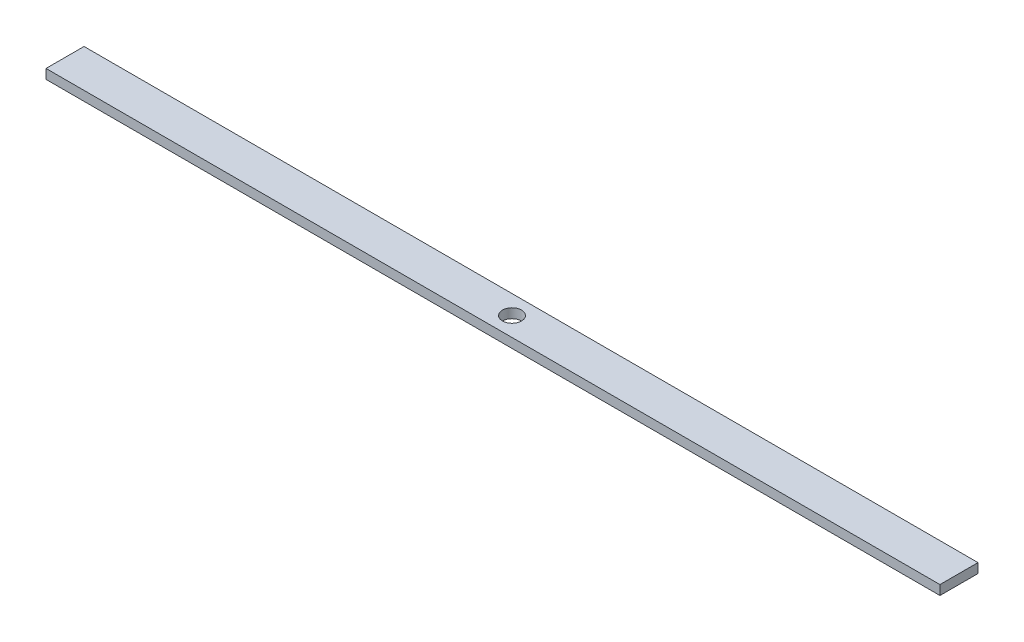
ISO-10303-21;
HEADER;
FILE_DESCRIPTION(('STEP AP214'),'2;1');
FILE_NAME('part.step','',(''),(''),'','','');
FILE_SCHEMA(('AUTOMOTIVE_DESIGN { 1 0 10303 214 1 1 1 1 }'));
ENDSEC;
DATA;
#1=APPLICATION_CONTEXT('core data for automotive mechanical design processes');
#2=APPLICATION_PROTOCOL_DEFINITION('international standard','automotive_design',2000,#1);
#3=PRODUCT_CONTEXT('',#1,'mechanical');
#4=PRODUCT('Part','Part','',(#3));
#5=PRODUCT_RELATED_PRODUCT_CATEGORY('part','',(#4));
#6=PRODUCT_DEFINITION_FORMATION('','',#4);
#7=PRODUCT_DEFINITION_CONTEXT('part definition',#1,'design');
#8=PRODUCT_DEFINITION('design','',#6,#7);
#9=PRODUCT_DEFINITION_SHAPE('','',#8);
#10=(LENGTH_UNIT() NAMED_UNIT(*) SI_UNIT(.MILLI.,.METRE.));
#11=(NAMED_UNIT(*) PLANE_ANGLE_UNIT() SI_UNIT($,.RADIAN.));
#12=(NAMED_UNIT(*) SI_UNIT($,.STERADIAN.) SOLID_ANGLE_UNIT());
#13=UNCERTAINTY_MEASURE_WITH_UNIT(LENGTH_MEASURE(1.E-05),#10,'distance_accuracy_value','');
#14=(GEOMETRIC_REPRESENTATION_CONTEXT(3) GLOBAL_UNCERTAINTY_ASSIGNED_CONTEXT((#13)) GLOBAL_UNIT_ASSIGNED_CONTEXT((#10,
#11,#12)) REPRESENTATION_CONTEXT('',''));
#15=CARTESIAN_POINT('',(0.,0.,0.));
#16=DIRECTION('',(0.,0.,1.));
#17=DIRECTION('',(1.,0.,0.));
#18=AXIS2_PLACEMENT_3D('',#15,#16,#17);
#19=CARTESIAN_POINT('',(0.,6.35,0.));
#20=DIRECTION('',(0.,1.,0.));
#21=DIRECTION('',(0.,0.,1.));
#22=AXIS2_PLACEMENT_3D('',#19,#20,#21);
#23=PLANE('',#22);
#24=DIRECTION('',(0.,0.,-1.));
#25=VECTOR('',#24,1.);
#26=CARTESIAN_POINT('',(298.45,6.35,-12.7));
#27=LINE('',#26,#25);
#28=CARTESIAN_POINT('',(298.45,6.35,12.7));
#29=VERTEX_POINT('',#28);
#30=CARTESIAN_POINT('',(298.45,6.35,-12.7));
#31=VERTEX_POINT('',#30);
#32=EDGE_CURVE('E92',#29,#31,#27,.T.);
#33=ORIENTED_EDGE('',*,*,#32,.T.);
#34=DIRECTION('',(-1.,0.,0.));
#35=VECTOR('',#34,1.);
#36=CARTESIAN_POINT('',(-298.45,6.35,-12.7));
#37=LINE('',#36,#35);
#38=CARTESIAN_POINT('',(-298.45,6.35,-12.7));
#39=VERTEX_POINT('',#38);
#40=EDGE_CURVE('E87',#31,#39,#37,.T.);
#41=ORIENTED_EDGE('',*,*,#40,.T.);
#42=DIRECTION('',(0.,0.,1.));
#43=VECTOR('',#42,1.);
#44=CARTESIAN_POINT('',(-298.45,6.35,-12.7));
#45=LINE('',#44,#43);
#46=CARTESIAN_POINT('',(-298.45,6.35,12.7));
#47=VERTEX_POINT('',#46);
#48=EDGE_CURVE('E90',#39,#47,#45,.T.);
#49=ORIENTED_EDGE('',*,*,#48,.T.);
#50=DIRECTION('',(1.,0.,0.));
#51=VECTOR('',#50,1.);
#52=CARTESIAN_POINT('',(-298.45,6.35,12.7));
#53=LINE('',#52,#51);
#54=EDGE_CURVE('E57',#47,#29,#53,.T.);
#55=ORIENTED_EDGE('',*,*,#54,.T.);
#56=EDGE_LOOP('',(#33,#41,#49,#55));
#57=FACE_BOUND('',#56,.T.);
#58=CARTESIAN_POINT('',(0.,6.35,0.));
#59=DIRECTION('',(0.,1.,0.));
#60=DIRECTION('',(0.,0.,1.));
#61=AXIS2_PLACEMENT_3D('',#58,#59,#60);
#62=CIRCLE('',#61,6.35);
#63=CARTESIAN_POINT('',(0.,6.35,6.35000000000001));
#64=VERTEX_POINT('',#63);
#65=EDGE_CURVE('E112',#64,#64,#62,.T.);
#66=ORIENTED_EDGE('',*,*,#65,.F.);
#67=EDGE_LOOP('',(#66));
#68=FACE_BOUND('',#67,.T.);
#69=ADVANCED_FACE('F39',(#57,#68),#23,.T.);
#70=CARTESIAN_POINT('',(0.,0.,0.));
#71=DIRECTION('',(0.,1.,0.));
#72=DIRECTION('',(0.,0.,1.));
#73=AXIS2_PLACEMENT_3D('',#70,#71,#72);
#74=PLANE('',#73);
#75=DIRECTION('',(0.,0.,-1.));
#76=VECTOR('',#75,1.);
#77=CARTESIAN_POINT('',(298.45,0.,-12.7));
#78=LINE('',#77,#76);
#79=CARTESIAN_POINT('',(298.45,0.,12.7));
#80=VERTEX_POINT('',#79);
#81=CARTESIAN_POINT('',(298.45,0.,-12.7));
#82=VERTEX_POINT('',#81);
#83=EDGE_CURVE('E108',#80,#82,#78,.T.);
#84=ORIENTED_EDGE('',*,*,#83,.F.);
#85=DIRECTION('',(1.,0.,0.));
#86=VECTOR('',#85,1.);
#87=CARTESIAN_POINT('',(-298.45,0.,12.7));
#88=LINE('',#87,#86);
#89=CARTESIAN_POINT('',(-298.45,0.,12.7));
#90=VERTEX_POINT('',#89);
#91=EDGE_CURVE('E80',#90,#80,#88,.T.);
#92=ORIENTED_EDGE('',*,*,#91,.F.);
#93=DIRECTION('',(0.,0.,1.));
#94=VECTOR('',#93,1.);
#95=CARTESIAN_POINT('',(-298.45,0.,-12.7));
#96=LINE('',#95,#94);
#97=CARTESIAN_POINT('',(-298.45,0.,-12.7));
#98=VERTEX_POINT('',#97);
#99=EDGE_CURVE('E74',#98,#90,#96,.T.);
#100=ORIENTED_EDGE('',*,*,#99,.F.);
#101=DIRECTION('',(-1.,0.,0.));
#102=VECTOR('',#101,1.);
#103=CARTESIAN_POINT('',(-298.45,0.,-12.7));
#104=LINE('',#103,#102);
#105=EDGE_CURVE('E97',#82,#98,#104,.T.);
#106=ORIENTED_EDGE('',*,*,#105,.F.);
#107=EDGE_LOOP('',(#84,#92,#100,#106));
#108=FACE_BOUND('',#107,.T.);
#109=CARTESIAN_POINT('',(0.,0.,0.));
#110=DIRECTION('',(0.,1.,0.));
#111=DIRECTION('',(0.,0.,1.));
#112=AXIS2_PLACEMENT_3D('',#109,#110,#111);
#113=CIRCLE('',#112,6.35);
#114=CARTESIAN_POINT('',(0.,0.,6.35000000000001));
#115=VERTEX_POINT('',#114);
#116=EDGE_CURVE('E130',#115,#115,#113,.T.);
#117=ORIENTED_EDGE('',*,*,#116,.T.);
#118=EDGE_LOOP('',(#117));
#119=FACE_BOUND('',#118,.T.);
#120=ADVANCED_FACE('F125',(#108,#119),#74,.F.);
#121=CARTESIAN_POINT('',(298.45,6.35,-12.7));
#122=DIRECTION('',(-1.,0.,0.));
#123=DIRECTION('',(0.,0.,1.));
#124=AXIS2_PLACEMENT_3D('',#121,#122,#123);
#125=PLANE('',#124);
#126=ORIENTED_EDGE('',*,*,#83,.T.);
#127=DIRECTION('',(0.,-1.,0.));
#128=VECTOR('',#127,1.);
#129=CARTESIAN_POINT('',(298.45,6.35,-12.7));
#130=LINE('',#129,#128);
#131=EDGE_CURVE('E11',#31,#82,#130,.T.);
#132=ORIENTED_EDGE('',*,*,#131,.F.);
#133=ORIENTED_EDGE('',*,*,#32,.F.);
#134=DIRECTION('',(0.,-1.,0.));
#135=VECTOR('',#134,1.);
#136=CARTESIAN_POINT('',(298.45,6.35,12.7));
#137=LINE('',#136,#135);
#138=EDGE_CURVE('E104',#29,#80,#137,.T.);
#139=ORIENTED_EDGE('',*,*,#138,.T.);
#140=EDGE_LOOP('',(#126,#132,#133,#139));
#141=FACE_BOUND('',#140,.T.);
#142=ADVANCED_FACE('F41',(#141),#125,.F.);
#143=CARTESIAN_POINT('',(-298.45,6.35,-12.7));
#144=DIRECTION('',(0.,0.,1.));
#145=DIRECTION('',(1.,0.,0.));
#146=AXIS2_PLACEMENT_3D('',#143,#144,#145);
#147=PLANE('',#146);
#148=ORIENTED_EDGE('',*,*,#105,.T.);
#149=DIRECTION('',(0.,-1.,0.));
#150=VECTOR('',#149,1.);
#151=CARTESIAN_POINT('',(-298.45,6.35,-12.7));
#152=LINE('',#151,#150);
#153=EDGE_CURVE('E49',#39,#98,#152,.T.);
#154=ORIENTED_EDGE('',*,*,#153,.F.);
#155=ORIENTED_EDGE('',*,*,#40,.F.);
#156=ORIENTED_EDGE('',*,*,#131,.T.);
#157=EDGE_LOOP('',(#148,#154,#155,#156));
#158=FACE_BOUND('',#157,.T.);
#159=ADVANCED_FACE('F96',(#158),#147,.F.);
#160=CARTESIAN_POINT('',(-298.45,6.35,-12.7));
#161=DIRECTION('',(1.,0.,0.));
#162=DIRECTION('',(0.,0.,-1.));
#163=AXIS2_PLACEMENT_3D('',#160,#161,#162);
#164=PLANE('',#163);
#165=ORIENTED_EDGE('',*,*,#99,.T.);
#166=DIRECTION('',(0.,-1.,0.));
#167=VECTOR('',#166,1.);
#168=CARTESIAN_POINT('',(-298.45,6.35,12.7));
#169=LINE('',#168,#167);
#170=EDGE_CURVE('E99',#47,#90,#169,.T.);
#171=ORIENTED_EDGE('',*,*,#170,.F.);
#172=ORIENTED_EDGE('',*,*,#48,.F.);
#173=ORIENTED_EDGE('',*,*,#153,.T.);
#174=EDGE_LOOP('',(#165,#171,#172,#173));
#175=FACE_BOUND('',#174,.T.);
#176=ADVANCED_FACE('F100',(#175),#164,.F.);
#177=CARTESIAN_POINT('',(-298.45,6.35,12.7));
#178=DIRECTION('',(0.,0.,-1.));
#179=DIRECTION('',(-1.,0.,0.));
#180=AXIS2_PLACEMENT_3D('',#177,#178,#179);
#181=PLANE('',#180);
#182=ORIENTED_EDGE('',*,*,#91,.T.);
#183=ORIENTED_EDGE('',*,*,#138,.F.);
#184=ORIENTED_EDGE('',*,*,#54,.F.);
#185=ORIENTED_EDGE('',*,*,#170,.T.);
#186=EDGE_LOOP('',(#182,#183,#184,#185));
#187=FACE_BOUND('',#186,.T.);
#188=ADVANCED_FACE('F122',(#187),#181,.F.);
#189=CARTESIAN_POINT('',(0.,6.35,0.));
#190=DIRECTION('',(0.,-1.,0.));
#191=DIRECTION('',(0.,0.,-1.));
#192=AXIS2_PLACEMENT_3D('',#189,#190,#191);
#193=CYLINDRICAL_SURFACE('',#192,6.35);
#194=ORIENTED_EDGE('',*,*,#65,.T.);
#195=EDGE_LOOP('',(#194));
#196=FACE_BOUND('',#195,.T.);
#197=ORIENTED_EDGE('',*,*,#116,.F.);
#198=EDGE_LOOP('',(#197));
#199=FACE_BOUND('',#198,.T.);
#200=ADVANCED_FACE('F138',(#196,#199),#193,.F.);
#201=CLOSED_SHELL('',(#69,#120,#142,#159,#176,#188,#200));
#202=MANIFOLD_SOLID_BREP('B2',#201);
#203=ADVANCED_BREP_SHAPE_REPRESENTATION('',(#18,#202),#14);
#204=SHAPE_DEFINITION_REPRESENTATION(#9,#203);
ENDSEC;
END-ISO-10303-21;
